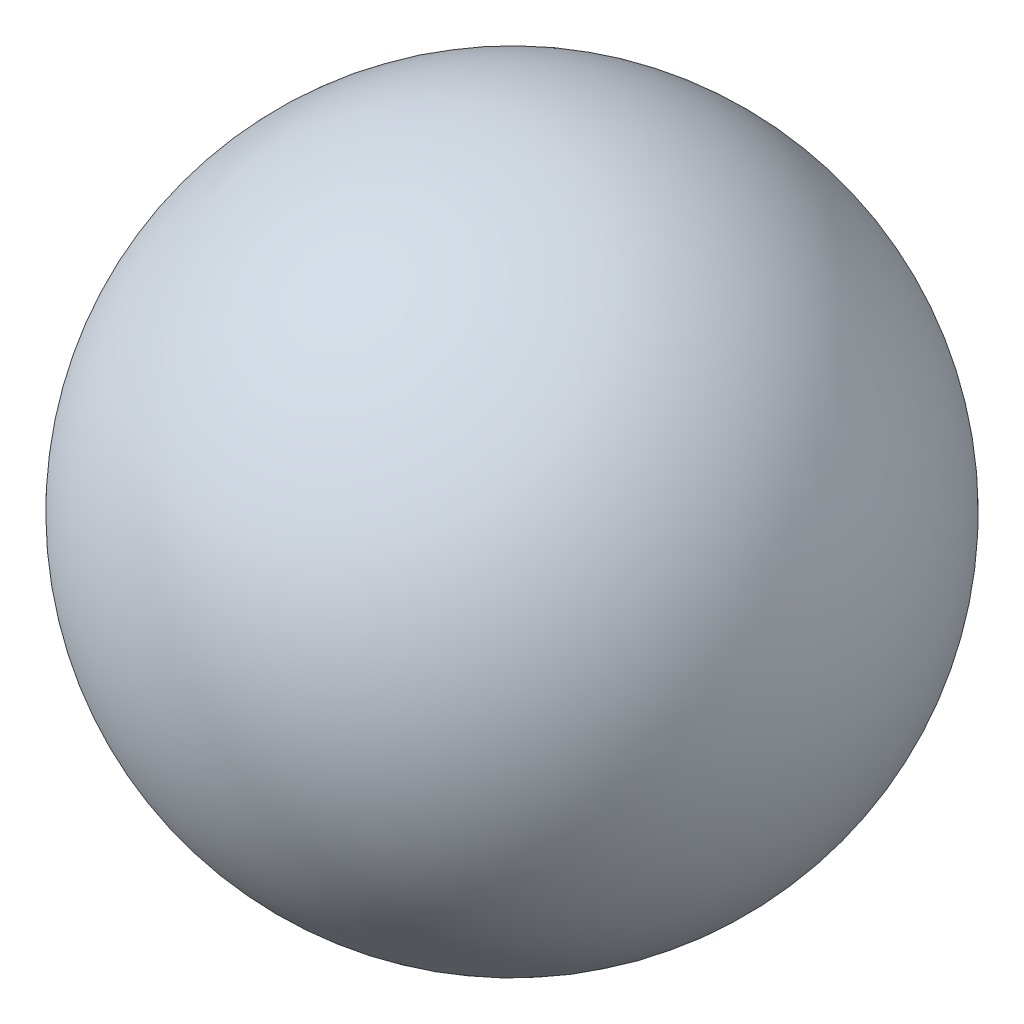
ISO-10303-21;
HEADER;
FILE_DESCRIPTION(('STEP AP214'),'2;1');
FILE_NAME('part.step','',(''),(''),'','','');
FILE_SCHEMA(('AUTOMOTIVE_DESIGN { 1 0 10303 214 1 1 1 1 }'));
ENDSEC;
DATA;
#1=APPLICATION_CONTEXT('core data for automotive mechanical design processes');
#2=APPLICATION_PROTOCOL_DEFINITION('international standard','automotive_design',2000,#1);
#3=PRODUCT_CONTEXT('',#1,'mechanical');
#4=PRODUCT('Part','Part','',(#3));
#5=PRODUCT_RELATED_PRODUCT_CATEGORY('part','',(#4));
#6=PRODUCT_DEFINITION_FORMATION('','',#4);
#7=PRODUCT_DEFINITION_CONTEXT('part definition',#1,'design');
#8=PRODUCT_DEFINITION('design','',#6,#7);
#9=PRODUCT_DEFINITION_SHAPE('','',#8);
#10=(LENGTH_UNIT() NAMED_UNIT(*) SI_UNIT(.MILLI.,.METRE.));
#11=(NAMED_UNIT(*) PLANE_ANGLE_UNIT() SI_UNIT($,.RADIAN.));
#12=(NAMED_UNIT(*) SI_UNIT($,.STERADIAN.) SOLID_ANGLE_UNIT());
#13=UNCERTAINTY_MEASURE_WITH_UNIT(LENGTH_MEASURE(1.E-05),#10,'distance_accuracy_value','');
#14=(GEOMETRIC_REPRESENTATION_CONTEXT(3) GLOBAL_UNCERTAINTY_ASSIGNED_CONTEXT((#13)) GLOBAL_UNIT_ASSIGNED_CONTEXT((#10,
#11,#12)) REPRESENTATION_CONTEXT('',''));
#15=CARTESIAN_POINT('',(0.,0.,0.));
#16=DIRECTION('',(0.,0.,1.));
#17=DIRECTION('',(1.,0.,0.));
#18=AXIS2_PLACEMENT_3D('',#15,#16,#17);
#19=CARTESIAN_POINT('',(-166.44086729741,0.,47.668095695273));
#20=DIRECTION('',(-0.684231613860294,0.,0.729264765770387));
#21=DIRECTION('',(-0.729264765770387,0.,-0.684231613860294));
#22=AXIS2_PLACEMENT_3D('',#19,#20,#21);
#23=SPHERICAL_SURFACE('',#22,88.9);
#24=CARTESIAN_POINT('',(-227.26905776959,0.,112.49973337226));
#25=VERTEX_POINT('',#24);
#26=VERTEX_LOOP('',#25);
#27=FACE_BOUND('',#26,.T.);
#28=ADVANCED_FACE('F35',(#27),#23,.T.);
#29=CLOSED_SHELL('',(#28));
#30=MANIFOLD_SOLID_BREP('B2',#29);
#31=ADVANCED_BREP_SHAPE_REPRESENTATION('',(#18,#30),#14);
#32=SHAPE_DEFINITION_REPRESENTATION(#9,#31);
ENDSEC;
END-ISO-10303-21;
